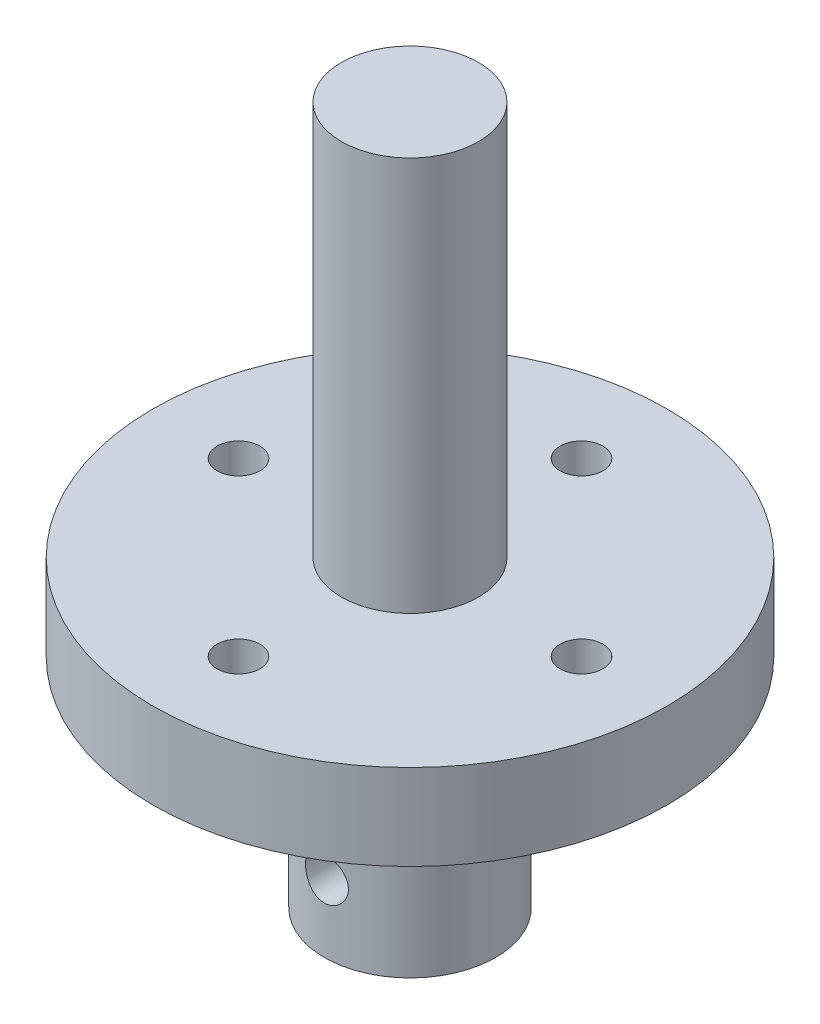
ISO-10303-21;
HEADER;
FILE_DESCRIPTION(('STEP AP214'),'2;1');
FILE_NAME('part.step','',(''),(''),'','','');
FILE_SCHEMA(('AUTOMOTIVE_DESIGN { 1 0 10303 214 1 1 1 1 }'));
ENDSEC;
DATA;
#1=APPLICATION_CONTEXT('core data for automotive mechanical design processes');
#2=APPLICATION_PROTOCOL_DEFINITION('international standard','automotive_design',2000,#1);
#3=PRODUCT_CONTEXT('',#1,'mechanical');
#4=PRODUCT('Part','Part','',(#3));
#5=PRODUCT_RELATED_PRODUCT_CATEGORY('part','',(#4));
#6=PRODUCT_DEFINITION_FORMATION('','',#4);
#7=PRODUCT_DEFINITION_CONTEXT('part definition',#1,'design');
#8=PRODUCT_DEFINITION('design','',#6,#7);
#9=PRODUCT_DEFINITION_SHAPE('','',#8);
#10=(LENGTH_UNIT() NAMED_UNIT(*) SI_UNIT(.MILLI.,.METRE.));
#11=(NAMED_UNIT(*) PLANE_ANGLE_UNIT() SI_UNIT($,.RADIAN.));
#12=(NAMED_UNIT(*) SI_UNIT($,.STERADIAN.) SOLID_ANGLE_UNIT());
#13=UNCERTAINTY_MEASURE_WITH_UNIT(LENGTH_MEASURE(1.E-05),#10,'distance_accuracy_value','');
#14=(GEOMETRIC_REPRESENTATION_CONTEXT(3) GLOBAL_UNCERTAINTY_ASSIGNED_CONTEXT((#13)) GLOBAL_UNIT_ASSIGNED_CONTEXT((#10,
#11,#12)) REPRESENTATION_CONTEXT('',''));
#15=CARTESIAN_POINT('',(0.,0.,0.));
#16=DIRECTION('',(0.,0.,1.));
#17=DIRECTION('',(1.,0.,0.));
#18=AXIS2_PLACEMENT_3D('',#15,#16,#17);
#19=CARTESIAN_POINT('',(0.,5.,0.));
#20=DIRECTION('',(0.,-1.,0.));
#21=DIRECTION('',(0.,0.,-1.));
#22=AXIS2_PLACEMENT_3D('',#19,#20,#21);
#23=CYLINDRICAL_SURFACE('',#22,15.);
#24=CARTESIAN_POINT('',(0.,5.,0.));
#25=DIRECTION('',(0.,1.,0.));
#26=DIRECTION('',(0.,0.,1.));
#27=AXIS2_PLACEMENT_3D('',#24,#25,#26);
#28=CIRCLE('',#27,15.);
#29=CARTESIAN_POINT('',(0.,5.,15.));
#30=VERTEX_POINT('',#29);
#31=EDGE_CURVE('E63',#30,#30,#28,.T.);
#32=ORIENTED_EDGE('',*,*,#31,.F.);
#33=EDGE_LOOP('',(#32));
#34=FACE_BOUND('',#33,.T.);
#35=CARTESIAN_POINT('',(0.,0.,0.));
#36=DIRECTION('',(0.,1.,0.));
#37=DIRECTION('',(0.,0.,1.));
#38=AXIS2_PLACEMENT_3D('',#35,#36,#37);
#39=CIRCLE('',#38,15.);
#40=CARTESIAN_POINT('',(0.,0.,15.));
#41=VERTEX_POINT('',#40);
#42=EDGE_CURVE('E58',#41,#41,#39,.T.);
#43=ORIENTED_EDGE('',*,*,#42,.T.);
#44=EDGE_LOOP('',(#43));
#45=FACE_BOUND('',#44,.T.);
#46=ADVANCED_FACE('F55',(#34,#45),#23,.T.);
#47=CARTESIAN_POINT('',(0.,5.,0.));
#48=DIRECTION('',(0.,1.,0.));
#49=DIRECTION('',(0.,0.,1.));
#50=AXIS2_PLACEMENT_3D('',#47,#48,#49);
#51=PLANE('',#50);
#52=CARTESIAN_POINT('',(0.,5.,0.));
#53=DIRECTION('',(0.,1.,0.));
#54=DIRECTION('',(0.,0.,1.));
#55=AXIS2_PLACEMENT_3D('',#52,#53,#54);
#56=CIRCLE('',#55,4.);
#57=CARTESIAN_POINT('',(0.,5.,4.));
#58=VERTEX_POINT('',#57);
#59=EDGE_CURVE('E195',#58,#58,#56,.T.);
#60=ORIENTED_EDGE('',*,*,#59,.F.);
#61=EDGE_LOOP('',(#60));
#62=FACE_BOUND('',#61,.T.);
#63=CARTESIAN_POINT('',(10.,5.,0.));
#64=DIRECTION('',(0.,1.,0.));
#65=DIRECTION('',(1.,0.,0.));
#66=AXIS2_PLACEMENT_3D('',#63,#64,#65);
#67=CIRCLE('',#66,1.25);
#68=CARTESIAN_POINT('',(11.25,5.,0.));
#69=VERTEX_POINT('',#68);
#70=EDGE_CURVE('E108',#69,#69,#67,.T.);
#71=ORIENTED_EDGE('',*,*,#70,.F.);
#72=EDGE_LOOP('',(#71));
#73=FACE_BOUND('',#72,.T.);
#74=CARTESIAN_POINT('',(0.,5.,-10.));
#75=DIRECTION('',(0.,1.,0.));
#76=DIRECTION('',(0.,0.,-1.));
#77=AXIS2_PLACEMENT_3D('',#74,#75,#76);
#78=CIRCLE('',#77,1.25);
#79=CARTESIAN_POINT('',(0.,5.,-11.25));
#80=VERTEX_POINT('',#79);
#81=EDGE_CURVE('E100',#80,#80,#78,.T.);
#82=ORIENTED_EDGE('',*,*,#81,.F.);
#83=EDGE_LOOP('',(#82));
#84=FACE_BOUND('',#83,.T.);
#85=CARTESIAN_POINT('',(-10.,5.,1.04744440165294E-13));
#86=DIRECTION('',(0.,1.,0.));
#87=DIRECTION('',(-1.,0.,0.));
#88=AXIS2_PLACEMENT_3D('',#85,#86,#87);
#89=CIRCLE('',#88,1.25);
#90=CARTESIAN_POINT('',(-11.25,5.,1.17837495185956E-13));
#91=VERTEX_POINT('',#90);
#92=EDGE_CURVE('E91',#91,#91,#89,.T.);
#93=ORIENTED_EDGE('',*,*,#92,.F.);
#94=EDGE_LOOP('',(#93));
#95=FACE_BOUND('',#94,.T.);
#96=CARTESIAN_POINT('',(0.,5.,10.));
#97=DIRECTION('',(0.,1.,0.));
#98=DIRECTION('',(0.,0.,1.));
#99=AXIS2_PLACEMENT_3D('',#96,#97,#98);
#100=CIRCLE('',#99,1.25);
#101=CARTESIAN_POINT('',(0.,5.,11.25));
#102=VERTEX_POINT('',#101);
#103=EDGE_CURVE('E83',#102,#102,#100,.T.);
#104=ORIENTED_EDGE('',*,*,#103,.F.);
#105=EDGE_LOOP('',(#104));
#106=FACE_BOUND('',#105,.T.);
#107=ORIENTED_EDGE('',*,*,#31,.T.);
#108=EDGE_LOOP('',(#107));
#109=FACE_BOUND('',#108,.T.);
#110=ADVANCED_FACE('F177',(#62,#73,#84,#95,#106,#109),#51,.T.);
#111=CARTESIAN_POINT('',(0.,0.,0.));
#112=DIRECTION('',(0.,1.,0.));
#113=DIRECTION('',(0.,0.,1.));
#114=AXIS2_PLACEMENT_3D('',#111,#112,#113);
#115=PLANE('',#114);
#116=CARTESIAN_POINT('',(10.,0.,0.));
#117=DIRECTION('',(0.,1.,0.));
#118=DIRECTION('',(1.,0.,0.));
#119=AXIS2_PLACEMENT_3D('',#116,#117,#118);
#120=CIRCLE('',#119,1.25);
#121=CARTESIAN_POINT('',(11.25,0.,0.));
#122=VERTEX_POINT('',#121);
#123=EDGE_CURVE('E87',#122,#122,#120,.T.);
#124=ORIENTED_EDGE('',*,*,#123,.T.);
#125=EDGE_LOOP('',(#124));
#126=FACE_BOUND('',#125,.T.);
#127=CARTESIAN_POINT('',(0.,0.,-10.));
#128=DIRECTION('',(0.,1.,0.));
#129=DIRECTION('',(0.,0.,-1.));
#130=AXIS2_PLACEMENT_3D('',#127,#128,#129);
#131=CIRCLE('',#130,1.25);
#132=CARTESIAN_POINT('',(0.,0.,-11.25));
#133=VERTEX_POINT('',#132);
#134=EDGE_CURVE('E104',#133,#133,#131,.T.);
#135=ORIENTED_EDGE('',*,*,#134,.T.);
#136=EDGE_LOOP('',(#135));
#137=FACE_BOUND('',#136,.T.);
#138=CARTESIAN_POINT('',(-10.,0.,1.04744440165294E-13));
#139=DIRECTION('',(0.,1.,0.));
#140=DIRECTION('',(-1.,0.,0.));
#141=AXIS2_PLACEMENT_3D('',#138,#139,#140);
#142=CIRCLE('',#141,1.25);
#143=CARTESIAN_POINT('',(-11.25,0.,1.17837495185956E-13));
#144=VERTEX_POINT('',#143);
#145=EDGE_CURVE('E95',#144,#144,#142,.T.);
#146=ORIENTED_EDGE('',*,*,#145,.T.);
#147=EDGE_LOOP('',(#146));
#148=FACE_BOUND('',#147,.T.);
#149=CARTESIAN_POINT('',(0.,0.,10.));
#150=DIRECTION('',(0.,1.,0.));
#151=DIRECTION('',(0.,0.,1.));
#152=AXIS2_PLACEMENT_3D('',#149,#150,#151);
#153=CIRCLE('',#152,1.25);
#154=CARTESIAN_POINT('',(0.,0.,11.25));
#155=VERTEX_POINT('',#154);
#156=EDGE_CURVE('E79',#155,#155,#153,.T.);
#157=ORIENTED_EDGE('',*,*,#156,.T.);
#158=EDGE_LOOP('',(#157));
#159=FACE_BOUND('',#158,.T.);
#160=CARTESIAN_POINT('',(0.,0.,0.));
#161=DIRECTION('',(0.,-1.,0.));
#162=DIRECTION('',(0.,0.,-1.));
#163=AXIS2_PLACEMENT_3D('',#160,#161,#162);
#164=CIRCLE('',#163,5.);
#165=CARTESIAN_POINT('',(0.,0.,-5.));
#166=VERTEX_POINT('',#165);
#167=EDGE_CURVE('E11',#166,#166,#164,.T.);
#168=ORIENTED_EDGE('',*,*,#167,.F.);
#169=EDGE_LOOP('',(#168));
#170=FACE_BOUND('',#169,.T.);
#171=ORIENTED_EDGE('',*,*,#42,.F.);
#172=EDGE_LOOP('',(#171));
#173=FACE_BOUND('',#172,.T.);
#174=ADVANCED_FACE('F173',(#126,#137,#148,#159,#170,#173),#115,.F.);
#175=CARTESIAN_POINT('',(0.,-12.7,0.));
#176=DIRECTION('',(0.,1.,0.));
#177=DIRECTION('',(0.,0.,1.));
#178=AXIS2_PLACEMENT_3D('',#175,#176,#177);
#179=CYLINDRICAL_SURFACE('',#178,5.);
#180=CARTESIAN_POINT('',(0.,-9.94999999999999,5.));
#181=CARTESIAN_POINT('',(-0.0690634072247755,-9.94999806188486,4.99999883223344));
#182=CARTESIAN_POINT('',(-0.138148464858969,-9.94425704102184,4.99855481776523));
#183=CARTESIAN_POINT('',(-0.274338603142109,-9.92147904057749,4.99293428191577));
#184=CARTESIAN_POINT('',(-0.341442539058947,-9.90443565871845,4.98875621183307));
#185=CARTESIAN_POINT('',(-0.471684060152145,-9.85963395544825,4.97813021943366));
#186=CARTESIAN_POINT('',(-0.534826302858334,-9.8318885010706,4.97168502368406));
#187=CARTESIAN_POINT('',(-0.655560109920353,-9.76651550829597,4.95721119839661));
#188=CARTESIAN_POINT('',(-0.713151486957296,-9.72888763656755,4.94918251545042));
#189=CARTESIAN_POINT('',(-0.822334939417429,-9.64399934195482,4.93222844659834));
#190=CARTESIAN_POINT('',(-0.873796408384221,-9.59657368753401,4.92328922623777));
#191=CARTESIAN_POINT('',(-0.968124106002748,-9.49378982924256,4.90561350097941));
#192=CARTESIAN_POINT('',(-1.01098936412427,-9.43843073087791,4.89687701906957));
#193=CARTESIAN_POINT('',(-1.08752211899919,-9.32033731105213,4.88045646416425));
#194=CARTESIAN_POINT('',(-1.12104351327112,-9.25750564099133,4.87278995392171));
#195=CARTESIAN_POINT('',(-1.1769974237921,-9.12687632361803,4.85957912343519));
#196=CARTESIAN_POINT('',(-1.1994317128661,-9.05907947222853,4.85403446393991));
#197=CARTESIAN_POINT('',(-1.23212903067024,-8.9218804181646,4.84583730597959));
#198=CARTESIAN_POINT('',(-1.24262689027778,-8.85253758662516,4.84312909229522));
#199=CARTESIAN_POINT('',(-1.25188481255654,-8.71302619248834,4.84074468781451));
#200=CARTESIAN_POINT('',(-1.25064678484831,-8.64285776608449,4.8410680037387));
#201=CARTESIAN_POINT('',(-1.23665543719939,-8.5054868268796,4.84466004580515));
#202=CARTESIAN_POINT('',(-1.22418195015876,-8.43825364877908,4.84785719168233));
#203=CARTESIAN_POINT('',(-1.18852015575258,-8.30686579090725,4.85672258063736));
#204=CARTESIAN_POINT('',(-1.16533108505785,-8.24271133080918,4.8623909997558));
#205=CARTESIAN_POINT('',(-1.10865789828095,-8.11855165312328,4.87562594920156));
#206=CARTESIAN_POINT('',(-1.07507222269408,-8.05859485684204,4.88321106224518));
#207=CARTESIAN_POINT('',(-0.998630230012455,-7.9450677418693,4.89941425705322));
#208=CARTESIAN_POINT('',(-0.955772290674026,-7.89149854327729,4.90803251945613));
#209=CARTESIAN_POINT('',(-0.860552853901008,-7.790663653588,4.92563233783151));
#210=CARTESIAN_POINT('',(-0.80795521513821,-7.74362125828221,4.93461724564976));
#211=CARTESIAN_POINT('',(-0.695509931253077,-7.65898229794675,4.95171637982321));
#212=CARTESIAN_POINT('',(-0.635662064756613,-7.62138602144703,4.95983057957846));
#213=CARTESIAN_POINT('',(-0.510096573901154,-7.55662451147968,4.97431443411819));
#214=CARTESIAN_POINT('',(-0.444359494340514,-7.52949554978798,4.98067800106438));
#215=CARTESIAN_POINT('',(-0.309063340119064,-7.48673557857536,4.99089930826182));
#216=CARTESIAN_POINT('',(-0.239504999292066,-7.47110236965156,4.99475752782734));
#217=CARTESIAN_POINT('',(-0.100449975325019,-7.45211869536764,4.99946249392812));
#218=CARTESIAN_POINT('',(-0.0309972666568381,-7.44846414493725,5.00038377923565));
#219=CARTESIAN_POINT('',(0.107527395667926,-7.45270750171291,4.99932337345376));
#220=CARTESIAN_POINT('',(0.176599383037164,-7.46060436899928,4.99734194368205));
#221=CARTESIAN_POINT('',(0.311345223980411,-7.48747575699282,4.99074650939464));
#222=CARTESIAN_POINT('',(0.377054265807297,-7.50628438623083,4.98617195154843));
#223=CARTESIAN_POINT('',(0.50438107704376,-7.55425590335704,4.97490588861778));
#224=CARTESIAN_POINT('',(0.565998432527196,-7.58341983692765,4.9682141697491));
#225=CARTESIAN_POINT('',(0.684602612024872,-7.65186344072895,4.95327756605259));
#226=CARTESIAN_POINT('',(0.741487868196524,-7.69131342699731,4.94500722805777));
#227=CARTESIAN_POINT('',(0.847938844702703,-7.77899159066415,4.92787090989516));
#228=CARTESIAN_POINT('',(0.897503299144171,-7.82722128301409,4.91900482709754));
#229=CARTESIAN_POINT('',(0.989158806727272,-7.93250163403706,4.90140797467309));
#230=CARTESIAN_POINT('',(1.03103655635169,-7.98973975250202,4.89268586822734));
#231=CARTESIAN_POINT('',(1.10459229917724,-8.11061052872144,4.87660731981032));
#232=CARTESIAN_POINT('',(1.13627074513161,-8.17424290246647,4.86925081722522));
#233=CARTESIAN_POINT('',(1.18829285050774,-8.30575476867757,4.85681745612221));
#234=CARTESIAN_POINT('',(1.20870366387838,-8.37360635695335,4.85172712743255));
#235=CARTESIAN_POINT('',(1.23778804996148,-8.51192469824093,4.84438953408486));
#236=CARTESIAN_POINT('',(1.24646418956554,-8.58239087586041,4.84214164766614));
#237=CARTESIAN_POINT('',(1.25169882527832,-8.72176751987934,4.84079084336631));
#238=CARTESIAN_POINT('',(1.24859824815009,-8.79066452927061,4.8415994394022));
#239=CARTESIAN_POINT('',(1.23114773192738,-8.92691990722332,4.84606590839869));
#240=CARTESIAN_POINT('',(1.21679801890563,-8.99427830667804,4.84972372409881));
#241=CARTESIAN_POINT('',(1.17744276620232,-9.12517371588784,4.85942717235602));
#242=CARTESIAN_POINT('',(1.15250117056697,-9.18873108770017,4.86545846030258));
#243=CARTESIAN_POINT('',(1.09272076133755,-9.31080448559474,4.87923129770691));
#244=CARTESIAN_POINT('',(1.05788057502848,-9.3693198109891,4.88697308433978));
#245=CARTESIAN_POINT('',(0.978223123864275,-9.48129552416835,4.90354695219594));
#246=CARTESIAN_POINT('',(0.933169302426874,-9.53458422785329,4.91240220693131));
#247=CARTESIAN_POINT('',(0.834824475991442,-9.63295587066284,4.93006689371905));
#248=CARTESIAN_POINT('',(0.781531517717618,-9.67803685842747,4.93887631439216));
#249=CARTESIAN_POINT('',(0.667056322252155,-9.75950942380383,4.95564713039719));
#250=CARTESIAN_POINT('',(0.605748685263652,-9.79572884472631,4.9635902780489));
#251=CARTESIAN_POINT('',(0.477721716258727,-9.85728955245044,4.97754104145932));
#252=CARTESIAN_POINT('',(0.411006302863947,-9.88263863387377,4.98355004333151));
#253=CARTESIAN_POINT('',(0.287008544369558,-9.9179765252747,4.99206716304618));
#254=CARTESIAN_POINT('',(0.230316809090055,-9.92995936921119,4.99502154210576));
#255=CARTESIAN_POINT('',(0.115755059613568,-9.94597161968495,4.9989883769329));
#256=CARTESIAN_POINT('',(0.0578851343688464,-9.95000162442108,5.00000097875745));
#257=CARTESIAN_POINT('',(0.,-9.94999999999999,5.));
#258=B_SPLINE_CURVE_WITH_KNOTS('',3,(#180,#181,#182,#183,#184,#185,#186,#187,#188,#189,#190,
#191,#192,#193,#194,#195,#196,#197,#198,#199,#200,#201,#202,#203,#204,#205,#206,#207,#208,#209,
#210,#211,#212,#213,#214,#215,#216,#217,#218,#219,#220,#221,#222,#223,#224,#225,#226,#227,#228,
#229,#230,#231,#232,#233,#234,#235,#236,#237,#238,#239,#240,#241,#242,#243,#244,#245,#246,#247,
#248,#249,#250,#251,#252,#253,#254,#255,#256,#257),.UNSPECIFIED.,.T.,.F.,(4,2,2,2,2,2,2,2,2,2,2,
2,2,2,2,2,2,2,2,2,2,2,2,2,2,2,2,2,2,2,2,2,2,2,2,2,2,2,4),(0.,0.206978093726574,
0.414073531469914,0.620920751905086,0.827774950141103,1.03845362864282,1.24915607983384,
1.46298872954838,1.6767871764114,1.88630245916191,2.09578365093913,2.30018747505847,
2.50460586221697,2.71108773228231,2.91760575696801,3.13001250807515,3.34242574631871,
3.55556857507593,3.768670614072,3.97631924124395,4.1839491759395,4.38850228761696,
4.59307606101906,4.80127989637791,5.00951969173346,5.22287091003727,5.43621265624587,
5.64826878845028,5.86027852710337,6.06619816998841,6.27211367463359,6.47680333799536,
6.68152140114081,6.89157980341588,7.10168808142011,7.31560154582986,7.52936136517788,
7.70285202451787,7.87632963369195),.UNSPECIFIED.);
#259=CARTESIAN_POINT('',(0.,-9.94999999999999,5.));
#260=VERTEX_POINT('',#259);
#261=EDGE_CURVE('E96',#260,#260,#258,.T.);
#262=ORIENTED_EDGE('',*,*,#261,.T.);
#263=EDGE_LOOP('',(#262));
#264=FACE_BOUND('',#263,.T.);
#265=CARTESIAN_POINT('',(0.,-12.7,0.));
#266=DIRECTION('',(0.,-1.,0.));
#267=DIRECTION('',(0.,0.,-1.));
#268=AXIS2_PLACEMENT_3D('',#265,#266,#267);
#269=CIRCLE('',#268,5.);
#270=CARTESIAN_POINT('',(0.,-12.7,-5.));
#271=VERTEX_POINT('',#270);
#272=EDGE_CURVE('E70',#271,#271,#269,.T.);
#273=ORIENTED_EDGE('',*,*,#272,.F.);
#274=EDGE_LOOP('',(#273));
#275=FACE_BOUND('',#274,.T.);
#276=ORIENTED_EDGE('',*,*,#167,.T.);
#277=EDGE_LOOP('',(#276));
#278=FACE_BOUND('',#277,.T.);
#279=ADVANCED_FACE('F129',(#264,#275,#278),#179,.T.);
#280=CARTESIAN_POINT('',(0.,-12.7,0.));
#281=DIRECTION('',(0.,-1.,0.));
#282=DIRECTION('',(0.,0.,-1.));
#283=AXIS2_PLACEMENT_3D('',#280,#281,#282);
#284=PLANE('',#283);
#285=CARTESIAN_POINT('',(0.,-12.7,0.));
#286=DIRECTION('',(0.,-1.,0.));
#287=DIRECTION('',(0.,0.,-1.));
#288=AXIS2_PLACEMENT_3D('',#285,#286,#287);
#289=CIRCLE('',#288,2.);
#290=CARTESIAN_POINT('',(0.,-12.7,-2.));
#291=VERTEX_POINT('',#290);
#292=EDGE_CURVE('E75',#291,#291,#289,.T.);
#293=ORIENTED_EDGE('',*,*,#292,.F.);
#294=EDGE_LOOP('',(#293));
#295=FACE_BOUND('',#294,.T.);
#296=ORIENTED_EDGE('',*,*,#272,.T.);
#297=EDGE_LOOP('',(#296));
#298=FACE_BOUND('',#297,.T.);
#299=ADVANCED_FACE('F165',(#295,#298),#284,.T.);
#300=CARTESIAN_POINT('',(0.,-3.2,0.));
#301=DIRECTION('',(0.,-1.,0.));
#302=DIRECTION('',(0.,0.,-1.));
#303=AXIS2_PLACEMENT_3D('',#300,#301,#302);
#304=CYLINDRICAL_SURFACE('',#303,2.);
#305=CARTESIAN_POINT('',(1.24999999999999,-8.7,1.5612494995996));
#306=CARTESIAN_POINT('',(1.24999462210485,-8.63787971819707,1.56125800072559));
#307=CARTESIAN_POINT('',(1.24532693849665,-8.57566216462975,1.56502642708837));
#308=CARTESIAN_POINT('',(1.22698950832934,-8.45332367992062,1.57943717205478));
#309=CARTESIAN_POINT('',(1.2132953043055,-8.39320891363476,1.59009816464115));
#310=CARTESIAN_POINT('',(1.1778807391187,-8.27721767730116,1.61650085329041));
#311=CARTESIAN_POINT('',(1.15622993332784,-8.22130939131819,1.63219837418033));
#312=CARTESIAN_POINT('',(1.10571945561924,-8.11399113836185,1.66682950714433));
#313=CARTESIAN_POINT('',(1.07685958706091,-8.0625812941435,1.68576320748676));
#314=CARTESIAN_POINT('',(1.00823937928364,-7.95813484552302,1.72779611374712));
#315=CARTESIAN_POINT('',(0.967536093692499,-7.90580525916741,1.75111338227347));
#316=CARTESIAN_POINT('',(0.878308664496876,-7.80811730085504,1.79752820854877));
#317=CARTESIAN_POINT('',(0.82977778129741,-7.76276500271608,1.82062555863329));
#318=CARTESIAN_POINT('',(0.719186665258488,-7.67489641485188,1.86729453891009));
#319=CARTESIAN_POINT('',(0.656200568910554,-7.6333823318957,1.8905872224145));
#320=CARTESIAN_POINT('',(0.522404070837314,-7.56187479523685,1.9318323169914));
#321=CARTESIAN_POINT('',(0.45160150647824,-7.53186993424875,1.94979001179838));
#322=CARTESIAN_POINT('',(0.311776878362018,-7.48751768939294,1.97669841318201));
#323=CARTESIAN_POINT('',(0.243305636047241,-7.47188858360307,1.98637922422038));
#324=CARTESIAN_POINT('',(0.104105100662264,-7.4523679303566,1.99850544379202));
#325=CARTESIAN_POINT('',(0.0333782605640278,-7.44846404387945,2.00095845843657));
#326=CARTESIAN_POINT('',(-0.0980658284213388,-7.45235568927762,1.99852909107528));
#327=CARTESIAN_POINT('',(-0.158852523273784,-7.45865137630091,1.99458699811902));
#328=CARTESIAN_POINT('',(-0.278306645903667,-7.47986698436333,1.98145272261225));
#329=CARTESIAN_POINT('',(-0.336973913146972,-7.49478755723752,1.97226014325117));
#330=CARTESIAN_POINT('',(-0.45088911707707,-7.53260377509712,1.94938133614675));
#331=CARTESIAN_POINT('',(-0.50612787549323,-7.5555198240486,1.93568361673912));
#332=CARTESIAN_POINT('',(-0.612019220469379,-7.60846875525999,1.90485632889331));
#333=CARTESIAN_POINT('',(-0.662670758559997,-7.63850325889061,1.88772597874227));
#334=CARTESIAN_POINT('',(-0.764713515567038,-7.70902816532937,1.84893224750793));
#335=CARTESIAN_POINT('',(-0.815412344918946,-7.75035462674234,1.82697004307144));
#336=CARTESIAN_POINT('',(-0.909598595905494,-7.84013238022338,1.78195462752237));
#337=CARTESIAN_POINT('',(-0.953075338789628,-7.88859402644655,1.75889986449171));
#338=CARTESIAN_POINT('',(-1.03735445892931,-7.99870562290611,1.71071442112196));
#339=CARTESIAN_POINT('',(-1.07706615479946,-8.06125138085031,1.68570581533195));
#340=CARTESIAN_POINT('',(-1.14526153203308,-8.19364611977343,1.640141390954));
#341=CARTESIAN_POINT('',(-1.17376589603357,-8.26348134395542,1.6195774019168));
#342=CARTESIAN_POINT('',(-1.21218566853166,-8.38976940288788,1.59091876567121));
#343=CARTESIAN_POINT('',(-1.2250184172172,-8.44491096263768,1.58096704305273));
#344=CARTESIAN_POINT('',(-1.24310168537523,-8.55711518874894,1.56679138875766));
#345=CARTESIAN_POINT('',(-1.24836256353274,-8.6141751210399,1.56255963237429));
#346=CARTESIAN_POINT('',(-1.25098535954507,-8.72872868054027,1.56046133530165));
#347=CARTESIAN_POINT('',(-1.24832917576576,-8.78622300136582,1.56260938140436));
#348=CARTESIAN_POINT('',(-1.23525733555987,-8.8997805810316,1.57296042862705));
#349=CARTESIAN_POINT('',(-1.22483525320261,-8.95584261496292,1.58116844404657));
#350=CARTESIAN_POINT('',(-1.19704935724829,-9.06421838386581,1.60230060601958));
#351=CARTESIAN_POINT('',(-1.17980280626787,-9.11657867333152,1.61514477937172));
#352=CARTESIAN_POINT('',(-1.13902451938522,-9.21778733455698,1.64415573440842));
#353=CARTESIAN_POINT('',(-1.1154905527142,-9.2666344520245,1.66032369489909));
#354=CARTESIAN_POINT('',(-1.05765376772318,-9.36930603917703,1.69787203988937));
#355=CARTESIAN_POINT('',(-1.0221537381422,-9.42230754124933,1.7196587573829));
#356=CARTESIAN_POINT('',(-0.943690263224852,-9.52218505243915,1.76393958000712));
#357=CARTESIAN_POINT('',(-0.900719074496589,-9.56905461697796,1.78643439903355));
#358=CARTESIAN_POINT('',(-0.800380659499182,-9.66298324624316,1.83383164018973));
#359=CARTESIAN_POINT('',(-0.741809949714152,-9.70886855700768,1.85854204787597));
#360=CARTESIAN_POINT('',(-0.616299987869566,-9.79006865187585,1.90384248965));
#361=CARTESIAN_POINT('',(-0.54936467874865,-9.82538838997364,1.92443445329133));
#362=CARTESIAN_POINT('',(-0.412925900636587,-9.88199499120264,1.95809255957562));
#363=CARTESIAN_POINT('',(-0.343814822544507,-9.90399420647076,1.9715348458918));
#364=CARTESIAN_POINT('',(-0.201860998884735,-9.93572666868108,1.9910701008804));
#365=CARTESIAN_POINT('',(-0.129023563238357,-9.94547688976111,1.99717323933003));
#366=CARTESIAN_POINT('',(0.0065990719968209,-9.95154652003878,2.00096685748559));
#367=CARTESIAN_POINT('',(0.0692812975954823,-9.94963577678698,1.99976600623617));
#368=CARTESIAN_POINT('',(0.193279811091733,-9.93653832502565,1.99160739958772));
#369=CARTESIAN_POINT('',(0.25459616084075,-9.92535203742422,1.98464990541518));
#370=CARTESIAN_POINT('',(0.372043294685532,-9.8948395251234,1.9659610468898));
#371=CARTESIAN_POINT('',(0.428280180678315,-9.87580916012679,1.95440367471701));
#372=CARTESIAN_POINT('',(0.53671436911132,-9.83044007183593,1.92744968677265));
#373=CARTESIAN_POINT('',(0.588910988118244,-9.8041001155244,1.91205242331405));
#374=CARTESIAN_POINT('',(0.693656737470671,-9.74183942100879,1.87675342239824));
#375=CARTESIAN_POINT('',(0.745680127162216,-9.70520801868101,1.85655002466956));
#376=CARTESIAN_POINT('',(0.843216608355417,-9.62492336966729,1.81433640456237));
#377=CARTESIAN_POINT('',(0.888722243055233,-9.58126219975405,1.7923241573062));
#378=CARTESIAN_POINT('',(0.978723601300808,-9.48088373769672,1.74500415099525));
#379=CARTESIAN_POINT('',(1.02212829873816,-9.42319165482307,1.71967871446314));
#380=CARTESIAN_POINT('',(1.09877325005744,-9.30035533398987,1.67174821497037));
#381=CARTESIAN_POINT('',(1.132019125571,-9.23521524509239,1.64914165167051));
#382=CARTESIAN_POINT('',(1.18099110923231,-9.11359723207032,1.61429776080214));
#383=CARTESIAN_POINT('',(1.19896216276381,-9.05836431912062,1.60087340349652));
#384=CARTESIAN_POINT('',(1.22712822180407,-8.94503072204279,1.5793915843794));
#385=CARTESIAN_POINT('',(1.23734784245404,-8.88693974497584,1.57131714400176));
#386=CARTESIAN_POINT('',(1.24559906183097,-8.80696947613714,1.56476456389394));
#387=CARTESIAN_POINT('',(1.2472467125958,-8.785635854483,1.56345069546827));
#388=CARTESIAN_POINT('',(1.24944824734287,-8.74287203347851,1.56169158695047));
#389=CARTESIAN_POINT('',(1.25000185626673,-8.72144181119831,1.56124656529968));
#390=CARTESIAN_POINT('',(1.24999999999999,-8.7,1.5612494995996));
#391=B_SPLINE_CURVE_WITH_KNOTS('',3,(#305,#306,#307,#308,#309,#310,#311,#312,#313,#314,#315,
#316,#317,#318,#319,#320,#321,#322,#323,#324,#325,#326,#327,#328,#329,#330,#331,#332,#333,#334,
#335,#336,#337,#338,#339,#340,#341,#342,#343,#344,#345,#346,#347,#348,#349,#350,#351,#352,#353,
#354,#355,#356,#357,#358,#359,#360,#361,#362,#363,#364,#365,#366,#367,#368,#369,#370,#371,#372,
#373,#374,#375,#376,#377,#378,#379,#380,#381,#382,#383,#384,#385,#386,#387,#388,#389,#390),
.UNSPECIFIED.,.T.,.F.,(4,2,2,2,2,2,2,2,2,2,2,2,2,2,2,2,2,2,2,2,2,2,2,2,2,2,2,2,2,2,2,2,2,2,2,2,
2,2,2,2,2,2,4),(0.,0.186262444012012,0.373031654397093,0.558205556130401,0.743384509377745,
0.953406207440068,1.1636097099791,1.39917236034456,1.63450092739259,1.84590412815397,
2.05708478092386,2.2399231958351,2.42277543076413,2.60609774825955,2.7894618612817,
2.99564504832106,3.20213044016184,3.4355806792082,3.66859805095276,3.84032775480266,
4.01182230007288,4.18370925240737,4.35573859160079,4.52493212343597,4.69418576487134,
4.89566333610127,5.09735098485252,5.33136598660887,5.56527109061624,5.78520080494547,
6.00482541258959,6.19203601525121,6.3792381230858,6.55994569114421,6.74068376037878,
6.94018144108743,7.13990556958865,7.36841817421246,7.59680409585383,7.77496902270409,
7.95256577963382,8.01684109069494,8.08113255947018),.UNSPECIFIED.);
#392=CARTESIAN_POINT('',(1.24999999999999,-8.7,1.5612494995996));
#393=VERTEX_POINT('',#392);
#394=EDGE_CURVE('E123',#393,#393,#391,.T.);
#395=ORIENTED_EDGE('',*,*,#394,.T.);
#396=EDGE_LOOP('',(#395));
#397=FACE_BOUND('',#396,.T.);
#398=CARTESIAN_POINT('',(0.,-3.2,0.));
#399=DIRECTION('',(0.,-1.,0.));
#400=DIRECTION('',(0.,0.,-1.));
#401=AXIS2_PLACEMENT_3D('',#398,#399,#400);
#402=CIRCLE('',#401,2.);
#403=CARTESIAN_POINT('',(0.,-3.2,-2.));
#404=VERTEX_POINT('',#403);
#405=EDGE_CURVE('E74',#404,#404,#402,.T.);
#406=ORIENTED_EDGE('',*,*,#405,.F.);
#407=EDGE_LOOP('',(#406));
#408=FACE_BOUND('',#407,.T.);
#409=ORIENTED_EDGE('',*,*,#292,.T.);
#410=EDGE_LOOP('',(#409));
#411=FACE_BOUND('',#410,.T.);
#412=ADVANCED_FACE('F162',(#397,#408,#411),#304,.F.);
#413=CARTESIAN_POINT('',(0.,-3.2,0.));
#414=DIRECTION('',(0.,-1.,0.));
#415=DIRECTION('',(0.,0.,-1.));
#416=AXIS2_PLACEMENT_3D('',#413,#414,#415);
#417=PLANE('',#416);
#418=ORIENTED_EDGE('',*,*,#405,.T.);
#419=EDGE_LOOP('',(#418));
#420=FACE_BOUND('',#419,.T.);
#421=ADVANCED_FACE('F158',(#420),#417,.T.);
#422=CARTESIAN_POINT('',(0.,0.,10.));
#423=DIRECTION('',(0.,1.,0.));
#424=DIRECTION('',(0.,0.,1.));
#425=AXIS2_PLACEMENT_3D('',#422,#423,#424);
#426=CYLINDRICAL_SURFACE('',#425,1.25);
#427=ORIENTED_EDGE('',*,*,#156,.F.);
#428=EDGE_LOOP('',(#427));
#429=FACE_BOUND('',#428,.T.);
#430=ORIENTED_EDGE('',*,*,#103,.T.);
#431=EDGE_LOOP('',(#430));
#432=FACE_BOUND('',#431,.T.);
#433=ADVANCED_FACE('F154',(#429,#432),#426,.F.);
#434=CARTESIAN_POINT('',(-10.,0.,1.04744440165294E-13));
#435=DIRECTION('',(0.,1.,0.));
#436=DIRECTION('',(0.,0.,1.));
#437=AXIS2_PLACEMENT_3D('',#434,#435,#436);
#438=CYLINDRICAL_SURFACE('',#437,1.25);
#439=ORIENTED_EDGE('',*,*,#145,.F.);
#440=EDGE_LOOP('',(#439));
#441=FACE_BOUND('',#440,.T.);
#442=ORIENTED_EDGE('',*,*,#92,.T.);
#443=EDGE_LOOP('',(#442));
#444=FACE_BOUND('',#443,.T.);
#445=ADVANCED_FACE('F150',(#441,#444),#438,.F.);
#446=CARTESIAN_POINT('',(0.,0.,-10.));
#447=DIRECTION('',(0.,1.,0.));
#448=DIRECTION('',(0.,0.,1.));
#449=AXIS2_PLACEMENT_3D('',#446,#447,#448);
#450=CYLINDRICAL_SURFACE('',#449,1.25);
#451=ORIENTED_EDGE('',*,*,#134,.F.);
#452=EDGE_LOOP('',(#451));
#453=FACE_BOUND('',#452,.T.);
#454=ORIENTED_EDGE('',*,*,#81,.T.);
#455=EDGE_LOOP('',(#454));
#456=FACE_BOUND('',#455,.T.);
#457=ADVANCED_FACE('F146',(#453,#456),#450,.F.);
#458=CARTESIAN_POINT('',(10.,0.,0.));
#459=DIRECTION('',(0.,1.,0.));
#460=DIRECTION('',(0.,0.,1.));
#461=AXIS2_PLACEMENT_3D('',#458,#459,#460);
#462=CYLINDRICAL_SURFACE('',#461,1.25);
#463=ORIENTED_EDGE('',*,*,#123,.F.);
#464=EDGE_LOOP('',(#463));
#465=FACE_BOUND('',#464,.T.);
#466=ORIENTED_EDGE('',*,*,#70,.T.);
#467=EDGE_LOOP('',(#466));
#468=FACE_BOUND('',#467,.T.);
#469=ADVANCED_FACE('F138',(#465,#468),#462,.F.);
#470=CARTESIAN_POINT('',(0.,-8.7,5.));
#471=DIRECTION('',(0.,0.,1.));
#472=DIRECTION('',(1.,0.,0.));
#473=AXIS2_PLACEMENT_3D('',#470,#471,#472);
#474=CYLINDRICAL_SURFACE('',#473,1.24999999999999);
#475=ORIENTED_EDGE('',*,*,#394,.F.);
#476=EDGE_LOOP('',(#475));
#477=FACE_BOUND('',#476,.T.);
#478=ORIENTED_EDGE('',*,*,#261,.F.);
#479=EDGE_LOOP('',(#478));
#480=FACE_BOUND('',#479,.T.);
#481=ADVANCED_FACE('F133',(#477,#480),#474,.F.);
#482=CARTESIAN_POINT('',(0.,28.,0.));
#483=DIRECTION('',(0.,-1.,0.));
#484=DIRECTION('',(0.,0.,-1.));
#485=AXIS2_PLACEMENT_3D('',#482,#483,#484);
#486=CYLINDRICAL_SURFACE('',#485,4.);
#487=CARTESIAN_POINT('',(0.,28.,0.));
#488=DIRECTION('',(0.,1.,0.));
#489=DIRECTION('',(0.,0.,1.));
#490=AXIS2_PLACEMENT_3D('',#487,#488,#489);
#491=CIRCLE('',#490,4.);
#492=CARTESIAN_POINT('',(0.,28.,4.));
#493=VERTEX_POINT('',#492);
#494=EDGE_CURVE('E192',#493,#493,#491,.T.);
#495=ORIENTED_EDGE('',*,*,#494,.F.);
#496=EDGE_LOOP('',(#495));
#497=FACE_BOUND('',#496,.T.);
#498=ORIENTED_EDGE('',*,*,#59,.T.);
#499=EDGE_LOOP('',(#498));
#500=FACE_BOUND('',#499,.T.);
#501=ADVANCED_FACE('F137',(#497,#500),#486,.T.);
#502=CARTESIAN_POINT('',(0.,28.,0.));
#503=DIRECTION('',(0.,1.,0.));
#504=DIRECTION('',(0.,0.,1.));
#505=AXIS2_PLACEMENT_3D('',#502,#503,#504);
#506=PLANE('',#505);
#507=ORIENTED_EDGE('',*,*,#494,.T.);
#508=EDGE_LOOP('',(#507));
#509=FACE_BOUND('',#508,.T.);
#510=ADVANCED_FACE('F214',(#509),#506,.T.);
#511=CLOSED_SHELL('',(#46,#110,#174,#279,#299,#412,#421,#433,#445,#457,#469,#481,#501,#510));
#512=MANIFOLD_SOLID_BREP('B2',#511);
#513=ADVANCED_BREP_SHAPE_REPRESENTATION('',(#18,#512),#14);
#514=SHAPE_DEFINITION_REPRESENTATION(#9,#513);
ENDSEC;
END-ISO-10303-21;
